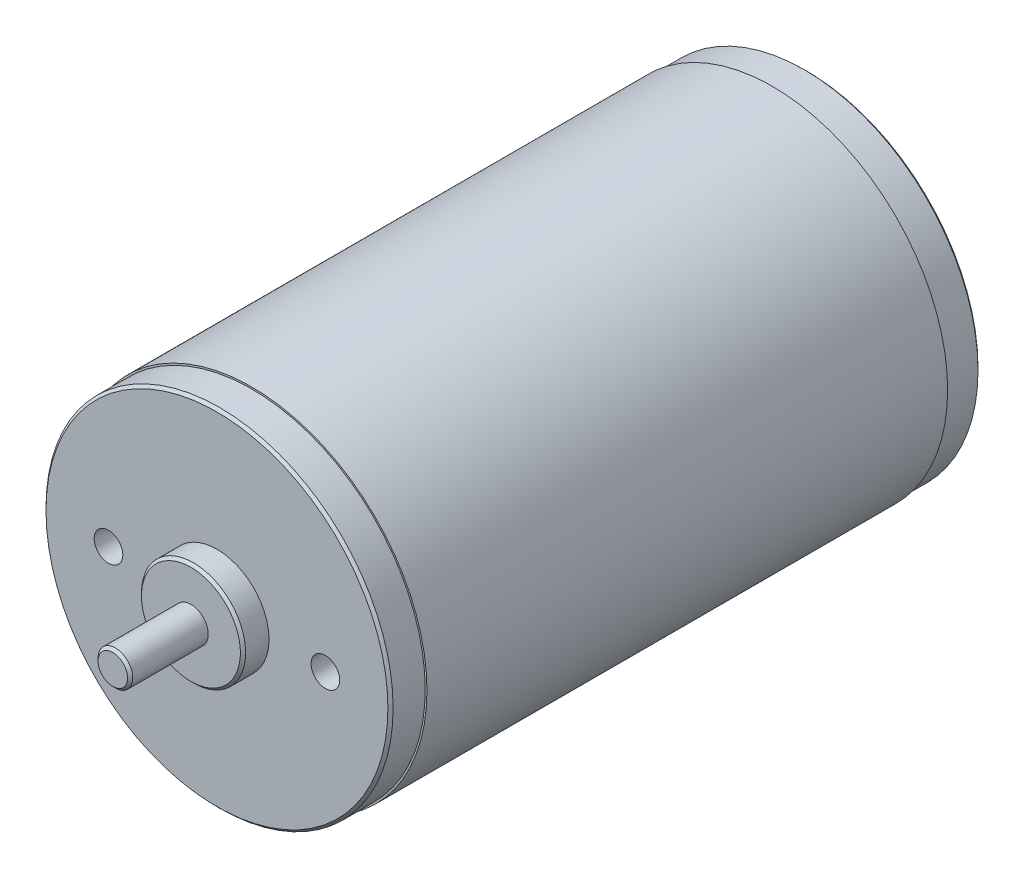
ISO-10303-21;
HEADER;
FILE_DESCRIPTION(('STEP AP214'),'2;1');
FILE_NAME('part.step','',(''),(''),'','','');
FILE_SCHEMA(('AUTOMOTIVE_DESIGN { 1 0 10303 214 1 1 1 1 }'));
ENDSEC;
DATA;
#1=APPLICATION_CONTEXT('core data for automotive mechanical design processes');
#2=APPLICATION_PROTOCOL_DEFINITION('international standard','automotive_design',2000,#1);
#3=PRODUCT_CONTEXT('',#1,'mechanical');
#4=PRODUCT('Part','Part','',(#3));
#5=PRODUCT_RELATED_PRODUCT_CATEGORY('part','',(#4));
#6=PRODUCT_DEFINITION_FORMATION('','',#4);
#7=PRODUCT_DEFINITION_CONTEXT('part definition',#1,'design');
#8=PRODUCT_DEFINITION('design','',#6,#7);
#9=PRODUCT_DEFINITION_SHAPE('','',#8);
#10=(LENGTH_UNIT() NAMED_UNIT(*) SI_UNIT(.MILLI.,.METRE.));
#11=(NAMED_UNIT(*) PLANE_ANGLE_UNIT() SI_UNIT($,.RADIAN.));
#12=(NAMED_UNIT(*) SI_UNIT($,.STERADIAN.) SOLID_ANGLE_UNIT());
#13=UNCERTAINTY_MEASURE_WITH_UNIT(LENGTH_MEASURE(1.E-05),#10,'distance_accuracy_value','');
#14=(GEOMETRIC_REPRESENTATION_CONTEXT(3) GLOBAL_UNCERTAINTY_ASSIGNED_CONTEXT((#13)) GLOBAL_UNIT_ASSIGNED_CONTEXT((#10,
#11,#12)) REPRESENTATION_CONTEXT('',''));
#15=CARTESIAN_POINT('',(0.,0.,0.));
#16=DIRECTION('',(0.,0.,1.));
#17=DIRECTION('',(1.,0.,0.));
#18=AXIS2_PLACEMENT_3D('',#15,#16,#17);
#19=CARTESIAN_POINT('',(0.,0.,12.));
#20=DIRECTION('',(0.,0.,1.));
#21=DIRECTION('',(1.,0.,0.));
#22=AXIS2_PLACEMENT_3D('',#19,#20,#21);
#23=PLANE('',#22);
#24=CARTESIAN_POINT('',(0.,0.,12.0000000000573));
#25=DIRECTION('',(0.,0.,-1.));
#26=DIRECTION('',(-1.,0.,0.));
#27=AXIS2_PLACEMENT_3D('',#24,#25,#26);
#28=CIRCLE('',#27,1.70000000002801);
#29=CARTESIAN_POINT('',(-1.70000000002801,0.,12.0000000000573));
#30=VERTEX_POINT('',#29);
#31=EDGE_CURVE('E19',#30,#30,#28,.T.);
#32=ORIENTED_EDGE('',*,*,#31,.F.);
#33=EDGE_LOOP('',(#32));
#34=FACE_BOUND('',#33,.T.);
#35=ADVANCED_FACE('F16',(#34),#23,.T.);
#36=CARTESIAN_POINT('',(0.,0.,11.7000000000758));
#37=DIRECTION('',(0.,0.,-1.));
#38=DIRECTION('',(-1.,0.,0.));
#39=AXIS2_PLACEMENT_3D('',#36,#37,#38);
#40=CONICAL_SURFACE('',#39,2.00000000000955,0.785398163397448);
#41=CARTESIAN_POINT('',(0.,0.,11.7));
#42=DIRECTION('',(0.,0.,-1.));
#43=DIRECTION('',(-1.,0.,0.));
#44=AXIS2_PLACEMENT_3D('',#41,#42,#43);
#45=CIRCLE('',#44,2.);
#46=CARTESIAN_POINT('',(-2.,0.,11.7));
#47=VERTEX_POINT('',#46);
#48=EDGE_CURVE('E62',#47,#47,#45,.T.);
#49=ORIENTED_EDGE('',*,*,#48,.F.);
#50=EDGE_LOOP('',(#49));
#51=FACE_BOUND('',#50,.T.);
#52=ORIENTED_EDGE('',*,*,#31,.T.);
#53=EDGE_LOOP('',(#52));
#54=FACE_BOUND('',#53,.T.);
#55=ADVANCED_FACE('F119',(#51,#54),#40,.T.);
#56=CARTESIAN_POINT('',(0.,0.,12.));
#57=DIRECTION('',(0.,0.,-1.));
#58=DIRECTION('',(-1.,0.,0.));
#59=AXIS2_PLACEMENT_3D('',#56,#57,#58);
#60=CYLINDRICAL_SURFACE('',#59,2.);
#61=CARTESIAN_POINT('',(0.,0.,3.));
#62=DIRECTION('',(0.,0.,-1.));
#63=DIRECTION('',(-1.,0.,0.));
#64=AXIS2_PLACEMENT_3D('',#61,#62,#63);
#65=CIRCLE('',#64,2.);
#66=CARTESIAN_POINT('',(-2.,0.,3.));
#67=VERTEX_POINT('',#66);
#68=EDGE_CURVE('E65',#67,#67,#65,.T.);
#69=ORIENTED_EDGE('',*,*,#68,.F.);
#70=EDGE_LOOP('',(#69));
#71=FACE_BOUND('',#70,.T.);
#72=ORIENTED_EDGE('',*,*,#48,.T.);
#73=EDGE_LOOP('',(#72));
#74=FACE_BOUND('',#73,.T.);
#75=ADVANCED_FACE('F115',(#71,#74),#60,.T.);
#76=CARTESIAN_POINT('',(0.,0.,-69.5));
#77=DIRECTION('',(0.,0.,-1.));
#78=DIRECTION('',(-1.,0.,0.));
#79=AXIS2_PLACEMENT_3D('',#76,#77,#78);
#80=PLANE('',#79);
#81=CARTESIAN_POINT('',(0.,0.,-69.5000000000618));
#82=DIRECTION('',(0.,0.,1.));
#83=DIRECTION('',(1.,0.,0.));
#84=AXIS2_PLACEMENT_3D('',#81,#82,#83);
#85=CIRCLE('',#84,6.02500000002237);
#86=CARTESIAN_POINT('',(6.02500000002237,0.,-69.5000000000618));
#87=VERTEX_POINT('',#86);
#88=EDGE_CURVE('E106',#87,#87,#85,.T.);
#89=ORIENTED_EDGE('',*,*,#88,.F.);
#90=EDGE_LOOP('',(#89));
#91=FACE_BOUND('',#90,.T.);
#92=ADVANCED_FACE('F118',(#91),#80,.T.);
#93=CARTESIAN_POINT('',(0.,0.,3.));
#94=DIRECTION('',(0.,0.,1.));
#95=DIRECTION('',(1.,0.,0.));
#96=AXIS2_PLACEMENT_3D('',#93,#94,#95);
#97=PLANE('',#96);
#98=ORIENTED_EDGE('',*,*,#68,.T.);
#99=EDGE_LOOP('',(#98));
#100=FACE_BOUND('',#99,.T.);
#101=CARTESIAN_POINT('',(0.,0.,2.9999999999859));
#102=DIRECTION('',(0.,0.,-1.));
#103=DIRECTION('',(-1.,0.,0.));
#104=AXIS2_PLACEMENT_3D('',#101,#102,#103);
#105=CIRCLE('',#104,5.70000000004711);
#106=CARTESIAN_POINT('',(-5.70000000004711,0.,2.9999999999859));
#107=VERTEX_POINT('',#106);
#108=EDGE_CURVE('E58',#107,#107,#105,.T.);
#109=ORIENTED_EDGE('',*,*,#108,.F.);
#110=EDGE_LOOP('',(#109));
#111=FACE_BOUND('',#110,.T.);
#112=ADVANCED_FACE('F112',(#100,#111),#97,.T.);
#113=CARTESIAN_POINT('',(0.,0.,-69.2000000000803));
#114=DIRECTION('',(0.,0.,1.));
#115=DIRECTION('',(1.,0.,0.));
#116=AXIS2_PLACEMENT_3D('',#113,#114,#115);
#117=CONICAL_SURFACE('',#116,6.32500000000391,0.785398163397448);
#118=ORIENTED_EDGE('',*,*,#88,.T.);
#119=EDGE_LOOP('',(#118));
#120=FACE_BOUND('',#119,.T.);
#121=CARTESIAN_POINT('',(0.,0.,-69.2));
#122=DIRECTION('',(0.,0.,1.));
#123=DIRECTION('',(1.,0.,0.));
#124=AXIS2_PLACEMENT_3D('',#121,#122,#123);
#125=CIRCLE('',#124,6.325);
#126=CARTESIAN_POINT('',(6.325,0.,-69.2));
#127=VERTEX_POINT('',#126);
#128=EDGE_CURVE('E47',#127,#127,#125,.T.);
#129=ORIENTED_EDGE('',*,*,#128,.F.);
#130=EDGE_LOOP('',(#129));
#131=FACE_BOUND('',#130,.T.);
#132=ADVANCED_FACE('F39',(#120,#131),#117,.T.);
#133=CARTESIAN_POINT('',(-12.5,0.,-8.10000000012678));
#134=DIRECTION('',(0.,0.,1.));
#135=DIRECTION('',(1.,0.,0.));
#136=AXIS2_PLACEMENT_3D('',#133,#134,#135);
#137=CONICAL_SURFACE('',#136,1.6499999998814,1.02974425849465);
#138=CARTESIAN_POINT('',(-12.5000000002728,0.,-9.09142002154795));
#139=VERTEX_POINT('',#138);
#140=VERTEX_LOOP('',#139);
#141=FACE_BOUND('',#140,.T.);
#142=CARTESIAN_POINT('',(-12.5,0.,-8.1));
#143=DIRECTION('',(0.,0.,1.));
#144=DIRECTION('',(1.,0.,0.));
#145=AXIS2_PLACEMENT_3D('',#142,#143,#144);
#146=CIRCLE('',#145,1.65);
#147=CARTESIAN_POINT('',(-10.85,0.,-8.1));
#148=VERTEX_POINT('',#147);
#149=EDGE_CURVE('E43',#148,#148,#146,.T.);
#150=ORIENTED_EDGE('',*,*,#149,.T.);
#151=EDGE_LOOP('',(#150));
#152=FACE_BOUND('',#151,.T.);
#153=ADVANCED_FACE('F35',(#141,#152),#137,.F.);
#154=CARTESIAN_POINT('',(12.5,0.,-8.10000000012678));
#155=DIRECTION('',(0.,0.,1.));
#156=DIRECTION('',(1.,0.,0.));
#157=AXIS2_PLACEMENT_3D('',#154,#155,#156);
#158=CONICAL_SURFACE('',#157,1.64999999985866,1.02974425848248);
#159=CARTESIAN_POINT('',(12.4999999997328,0.,-9.09142002157637));
#160=VERTEX_POINT('',#159);
#161=VERTEX_LOOP('',#160);
#162=FACE_BOUND('',#161,.T.);
#163=CARTESIAN_POINT('',(12.5,0.,-8.1));
#164=DIRECTION('',(0.,0.,1.));
#165=DIRECTION('',(1.,0.,0.));
#166=AXIS2_PLACEMENT_3D('',#163,#164,#165);
#167=CIRCLE('',#166,1.65);
#168=CARTESIAN_POINT('',(14.15,0.,-8.1));
#169=VERTEX_POINT('',#168);
#170=EDGE_CURVE('E46',#169,#169,#167,.T.);
#171=ORIENTED_EDGE('',*,*,#170,.T.);
#172=EDGE_LOOP('',(#171));
#173=FACE_BOUND('',#172,.T.);
#174=ADVANCED_FACE('F38',(#162,#173),#158,.F.);
#175=CARTESIAN_POINT('',(0.,0.,2.70000000000437));
#176=DIRECTION('',(0.,0.,-1.));
#177=DIRECTION('',(-1.,0.,0.));
#178=AXIS2_PLACEMENT_3D('',#175,#176,#177);
#179=CONICAL_SURFACE('',#178,6.00000000002865,0.785398163397448);
#180=CARTESIAN_POINT('',(0.,0.,2.70000000000002));
#181=DIRECTION('',(0.,0.,-1.));
#182=DIRECTION('',(-1.,0.,0.));
#183=AXIS2_PLACEMENT_3D('',#180,#181,#182);
#184=CIRCLE('',#183,6.);
#185=CARTESIAN_POINT('',(-6.,0.,2.70000000000002));
#186=VERTEX_POINT('',#185);
#187=EDGE_CURVE('E54',#186,#186,#184,.T.);
#188=ORIENTED_EDGE('',*,*,#187,.F.);
#189=EDGE_LOOP('',(#188));
#190=FACE_BOUND('',#189,.T.);
#191=ORIENTED_EDGE('',*,*,#108,.T.);
#192=EDGE_LOOP('',(#191));
#193=FACE_BOUND('',#192,.T.);
#194=ADVANCED_FACE('F145',(#190,#193),#179,.T.);
#195=CARTESIAN_POINT('',(0.,0.,-69.5));
#196=DIRECTION('',(0.,0.,1.));
#197=DIRECTION('',(1.,0.,0.));
#198=AXIS2_PLACEMENT_3D('',#195,#196,#197);
#199=CYLINDRICAL_SURFACE('',#198,6.325);
#200=ORIENTED_EDGE('',*,*,#128,.T.);
#201=EDGE_LOOP('',(#200));
#202=FACE_BOUND('',#201,.T.);
#203=CARTESIAN_POINT('',(0.,0.,-68.));
#204=DIRECTION('',(0.,0.,1.));
#205=DIRECTION('',(1.,0.,0.));
#206=AXIS2_PLACEMENT_3D('',#203,#204,#205);
#207=CIRCLE('',#206,6.325);
#208=CARTESIAN_POINT('',(6.325,0.,-68.));
#209=VERTEX_POINT('',#208);
#210=EDGE_CURVE('E100',#209,#209,#207,.F.);
#211=ORIENTED_EDGE('',*,*,#210,.T.);
#212=EDGE_LOOP('',(#211));
#213=FACE_BOUND('',#212,.T.);
#214=ADVANCED_FACE('F148',(#202,#213),#199,.T.);
#215=CARTESIAN_POINT('',(-12.5,0.,0.));
#216=DIRECTION('',(0.,0.,1.));
#217=DIRECTION('',(1.,0.,0.));
#218=AXIS2_PLACEMENT_3D('',#215,#216,#217);
#219=CYLINDRICAL_SURFACE('',#218,1.65);
#220=CARTESIAN_POINT('',(-12.5,0.,0.));
#221=DIRECTION('',(0.,0.,1.));
#222=DIRECTION('',(1.,0.,0.));
#223=AXIS2_PLACEMENT_3D('',#220,#221,#222);
#224=CIRCLE('',#223,1.65);
#225=CARTESIAN_POINT('',(-10.85,0.,0.));
#226=VERTEX_POINT('',#225);
#227=EDGE_CURVE('E96',#226,#226,#224,.F.);
#228=ORIENTED_EDGE('',*,*,#227,.F.);
#229=EDGE_LOOP('',(#228));
#230=FACE_BOUND('',#229,.T.);
#231=ORIENTED_EDGE('',*,*,#149,.F.);
#232=EDGE_LOOP('',(#231));
#233=FACE_BOUND('',#232,.T.);
#234=ADVANCED_FACE('F208',(#230,#233),#219,.F.);
#235=CARTESIAN_POINT('',(12.5,0.,0.));
#236=DIRECTION('',(0.,0.,1.));
#237=DIRECTION('',(1.,0.,0.));
#238=AXIS2_PLACEMENT_3D('',#235,#236,#237);
#239=CYLINDRICAL_SURFACE('',#238,1.65);
#240=CARTESIAN_POINT('',(12.5,0.,0.));
#241=DIRECTION('',(0.,0.,1.));
#242=DIRECTION('',(1.,0.,0.));
#243=AXIS2_PLACEMENT_3D('',#240,#241,#242);
#244=CIRCLE('',#243,1.65);
#245=CARTESIAN_POINT('',(14.15,0.,0.));
#246=VERTEX_POINT('',#245);
#247=EDGE_CURVE('E92',#246,#246,#244,.F.);
#248=ORIENTED_EDGE('',*,*,#247,.F.);
#249=EDGE_LOOP('',(#248));
#250=FACE_BOUND('',#249,.T.);
#251=ORIENTED_EDGE('',*,*,#170,.F.);
#252=EDGE_LOOP('',(#251));
#253=FACE_BOUND('',#252,.T.);
#254=ADVANCED_FACE('F204',(#250,#253),#239,.F.);
#255=CARTESIAN_POINT('',(0.,0.,3.));
#256=DIRECTION('',(0.,0.,-1.));
#257=DIRECTION('',(-1.,0.,0.));
#258=AXIS2_PLACEMENT_3D('',#255,#256,#257);
#259=CYLINDRICAL_SURFACE('',#258,6.);
#260=CARTESIAN_POINT('',(0.,0.,0.));
#261=DIRECTION('',(0.,0.,-1.));
#262=DIRECTION('',(-1.,0.,0.));
#263=AXIS2_PLACEMENT_3D('',#260,#261,#262);
#264=CIRCLE('',#263,6.);
#265=CARTESIAN_POINT('',(-6.,0.,0.));
#266=VERTEX_POINT('',#265);
#267=EDGE_CURVE('E88',#266,#266,#264,.T.);
#268=ORIENTED_EDGE('',*,*,#267,.F.);
#269=EDGE_LOOP('',(#268));
#270=FACE_BOUND('',#269,.T.);
#271=ORIENTED_EDGE('',*,*,#187,.T.);
#272=EDGE_LOOP('',(#271));
#273=FACE_BOUND('',#272,.T.);
#274=ADVANCED_FACE('F143',(#270,#273),#259,.T.);
#275=CARTESIAN_POINT('',(0.,0.,-68.));
#276=DIRECTION('',(0.,0.,1.));
#277=DIRECTION('',(1.,0.,0.));
#278=AXIS2_PLACEMENT_3D('',#275,#276,#277);
#279=PLANE('',#278);
#280=ORIENTED_EDGE('',*,*,#210,.F.);
#281=EDGE_LOOP('',(#280));
#282=FACE_BOUND('',#281,.T.);
#283=CARTESIAN_POINT('',(0.,0.,-68.));
#284=DIRECTION('',(0.,0.,1.));
#285=DIRECTION('',(1.,0.,0.));
#286=AXIS2_PLACEMENT_3D('',#283,#284,#285);
#287=CIRCLE('',#286,19.7);
#288=CARTESIAN_POINT('',(19.7,0.,-68.));
#289=VERTEX_POINT('',#288);
#290=EDGE_CURVE('E84',#289,#289,#287,.T.);
#291=ORIENTED_EDGE('',*,*,#290,.F.);
#292=EDGE_LOOP('',(#291));
#293=FACE_BOUND('',#292,.T.);
#294=ADVANCED_FACE('F197',(#282,#293),#279,.F.);
#295=CARTESIAN_POINT('',(0.,0.,0.));
#296=DIRECTION('',(0.,0.,1.));
#297=DIRECTION('',(1.,0.,0.));
#298=AXIS2_PLACEMENT_3D('',#295,#296,#297);
#299=PLANE('',#298);
#300=ORIENTED_EDGE('',*,*,#267,.T.);
#301=EDGE_LOOP('',(#300));
#302=FACE_BOUND('',#301,.T.);
#303=ORIENTED_EDGE('',*,*,#247,.T.);
#304=EDGE_LOOP('',(#303));
#305=FACE_BOUND('',#304,.T.);
#306=ORIENTED_EDGE('',*,*,#227,.T.);
#307=EDGE_LOOP('',(#306));
#308=FACE_BOUND('',#307,.T.);
#309=CARTESIAN_POINT('',(0.,0.,0.));
#310=DIRECTION('',(0.,0.,-1.));
#311=DIRECTION('',(-1.,0.,0.));
#312=AXIS2_PLACEMENT_3D('',#309,#310,#311);
#313=CIRCLE('',#312,19.7);
#314=CARTESIAN_POINT('',(-19.7,0.,0.));
#315=VERTEX_POINT('',#314);
#316=EDGE_CURVE('E79',#315,#315,#313,.T.);
#317=ORIENTED_EDGE('',*,*,#316,.F.);
#318=EDGE_LOOP('',(#317));
#319=FACE_BOUND('',#318,.T.);
#320=ADVANCED_FACE('F193',(#302,#305,#308,#319),#299,.T.);
#321=CARTESIAN_POINT('',(0.,0.,-67.7));
#322=DIRECTION('',(0.,0.,1.));
#323=DIRECTION('',(1.,0.,0.));
#324=AXIS2_PLACEMENT_3D('',#321,#322,#323);
#325=CONICAL_SURFACE('',#324,20.,0.785398163397466);
#326=ORIENTED_EDGE('',*,*,#290,.T.);
#327=EDGE_LOOP('',(#326));
#328=FACE_BOUND('',#327,.T.);
#329=CARTESIAN_POINT('',(0.,0.,-67.7));
#330=DIRECTION('',(0.,0.,-1.));
#331=DIRECTION('',(-1.,0.,0.));
#332=AXIS2_PLACEMENT_3D('',#329,#330,#331);
#333=CIRCLE('',#332,20.);
#334=CARTESIAN_POINT('',(-20.,0.,-67.7));
#335=VERTEX_POINT('',#334);
#336=EDGE_CURVE('E83',#335,#335,#333,.F.);
#337=ORIENTED_EDGE('',*,*,#336,.F.);
#338=EDGE_LOOP('',(#337));
#339=FACE_BOUND('',#338,.T.);
#340=ADVANCED_FACE('F189',(#328,#339),#325,.T.);
#341=CARTESIAN_POINT('',(0.,0.,-0.299999999999963));
#342=DIRECTION('',(0.,0.,-1.));
#343=DIRECTION('',(-1.,0.,0.));
#344=AXIS2_PLACEMENT_3D('',#341,#342,#343);
#345=CONICAL_SURFACE('',#344,20.,0.785398163397472);
#346=ORIENTED_EDGE('',*,*,#316,.T.);
#347=EDGE_LOOP('',(#346));
#348=FACE_BOUND('',#347,.T.);
#349=CARTESIAN_POINT('',(0.,0.,-0.299999999999964));
#350=DIRECTION('',(0.,0.,1.));
#351=DIRECTION('',(1.,0.,0.));
#352=AXIS2_PLACEMENT_3D('',#349,#350,#351);
#353=CIRCLE('',#352,20.);
#354=CARTESIAN_POINT('',(20.,0.,-0.299999999999964));
#355=VERTEX_POINT('',#354);
#356=EDGE_CURVE('E78',#355,#355,#353,.F.);
#357=ORIENTED_EDGE('',*,*,#356,.F.);
#358=EDGE_LOOP('',(#357));
#359=FACE_BOUND('',#358,.T.);
#360=ADVANCED_FACE('F185',(#348,#359),#345,.T.);
#361=CARTESIAN_POINT('',(0.,0.,-64.));
#362=DIRECTION('',(0.,0.,-1.));
#363=DIRECTION('',(-1.,0.,0.));
#364=AXIS2_PLACEMENT_3D('',#361,#362,#363);
#365=CYLINDRICAL_SURFACE('',#364,20.);
#366=CARTESIAN_POINT('',(0.,0.,-64.));
#367=DIRECTION('',(0.,0.,-1.));
#368=DIRECTION('',(-1.,0.,0.));
#369=AXIS2_PLACEMENT_3D('',#366,#367,#368);
#370=CIRCLE('',#369,20.);
#371=CARTESIAN_POINT('',(-20.,0.,-64.));
#372=VERTEX_POINT('',#371);
#373=EDGE_CURVE('E74',#372,#372,#370,.F.);
#374=ORIENTED_EDGE('',*,*,#373,.F.);
#375=EDGE_LOOP('',(#374));
#376=FACE_BOUND('',#375,.T.);
#377=ORIENTED_EDGE('',*,*,#336,.T.);
#378=EDGE_LOOP('',(#377));
#379=FACE_BOUND('',#378,.T.);
#380=ADVANCED_FACE('F181',(#376,#379),#365,.T.);
#381=CARTESIAN_POINT('',(0.,0.,-4.));
#382=DIRECTION('',(0.,0.,1.));
#383=DIRECTION('',(1.,0.,0.));
#384=AXIS2_PLACEMENT_3D('',#381,#382,#383);
#385=CYLINDRICAL_SURFACE('',#384,20.);
#386=CARTESIAN_POINT('',(0.,0.,-4.));
#387=DIRECTION('',(0.,0.,1.));
#388=DIRECTION('',(1.,0.,0.));
#389=AXIS2_PLACEMENT_3D('',#386,#387,#388);
#390=CIRCLE('',#389,20.);
#391=CARTESIAN_POINT('',(20.,0.,-4.));
#392=VERTEX_POINT('',#391);
#393=EDGE_CURVE('E70',#392,#392,#390,.F.);
#394=ORIENTED_EDGE('',*,*,#393,.F.);
#395=EDGE_LOOP('',(#394));
#396=FACE_BOUND('',#395,.T.);
#397=ORIENTED_EDGE('',*,*,#356,.T.);
#398=EDGE_LOOP('',(#397));
#399=FACE_BOUND('',#398,.T.);
#400=ADVANCED_FACE('F177',(#396,#399),#385,.T.);
#401=CARTESIAN_POINT('',(0.,0.,-64.));
#402=DIRECTION('',(0.,0.,-1.));
#403=DIRECTION('',(-1.,0.,0.));
#404=AXIS2_PLACEMENT_3D('',#401,#402,#403);
#405=PLANE('',#404);
#406=CARTESIAN_POINT('',(0.,0.,-64.));
#407=DIRECTION('',(0.,0.,1.));
#408=DIRECTION('',(1.,0.,0.));
#409=AXIS2_PLACEMENT_3D('',#406,#407,#408);
#410=CIRCLE('',#409,20.2);
#411=CARTESIAN_POINT('',(20.2,0.,-64.));
#412=VERTEX_POINT('',#411);
#413=EDGE_CURVE('E26',#412,#412,#410,.T.);
#414=ORIENTED_EDGE('',*,*,#413,.F.);
#415=EDGE_LOOP('',(#414));
#416=FACE_BOUND('',#415,.T.);
#417=ORIENTED_EDGE('',*,*,#373,.T.);
#418=EDGE_LOOP('',(#417));
#419=FACE_BOUND('',#418,.T.);
#420=ADVANCED_FACE('F170',(#416,#419),#405,.T.);
#421=CARTESIAN_POINT('',(0.,0.,-4.));
#422=DIRECTION('',(0.,0.,1.));
#423=DIRECTION('',(1.,0.,0.));
#424=AXIS2_PLACEMENT_3D('',#421,#422,#423);
#425=PLANE('',#424);
#426=CARTESIAN_POINT('',(0.,0.,-4.));
#427=DIRECTION('',(0.,0.,1.));
#428=DIRECTION('',(1.,0.,0.));
#429=AXIS2_PLACEMENT_3D('',#426,#427,#428);
#430=CIRCLE('',#429,20.2);
#431=CARTESIAN_POINT('',(20.2,0.,-4.));
#432=VERTEX_POINT('',#431);
#433=EDGE_CURVE('E11',#432,#432,#430,.F.);
#434=ORIENTED_EDGE('',*,*,#433,.F.);
#435=EDGE_LOOP('',(#434));
#436=FACE_BOUND('',#435,.T.);
#437=ORIENTED_EDGE('',*,*,#393,.T.);
#438=EDGE_LOOP('',(#437));
#439=FACE_BOUND('',#438,.T.);
#440=ADVANCED_FACE('F164',(#436,#439),#425,.T.);
#441=CARTESIAN_POINT('',(0.,0.,-68.));
#442=DIRECTION('',(0.,0.,1.));
#443=DIRECTION('',(1.,0.,0.));
#444=AXIS2_PLACEMENT_3D('',#441,#442,#443);
#445=CYLINDRICAL_SURFACE('',#444,20.2);
#446=ORIENTED_EDGE('',*,*,#433,.T.);
#447=EDGE_LOOP('',(#446));
#448=FACE_BOUND('',#447,.T.);
#449=ORIENTED_EDGE('',*,*,#413,.T.);
#450=EDGE_LOOP('',(#449));
#451=FACE_BOUND('',#450,.T.);
#452=ADVANCED_FACE('F162',(#448,#451),#445,.T.);
#453=CLOSED_SHELL('',(#35,#55,#75,#92,#112,#132,#153,#174,#194,#214,#234,#254,#274,#294,#320,
#340,#360,#380,#400,#420,#440,#452));
#454=MANIFOLD_SOLID_BREP('B1',#453);
#455=ADVANCED_BREP_SHAPE_REPRESENTATION('',(#18,#454),#14);
#456=SHAPE_DEFINITION_REPRESENTATION(#9,#455);
ENDSEC;
END-ISO-10303-21;
